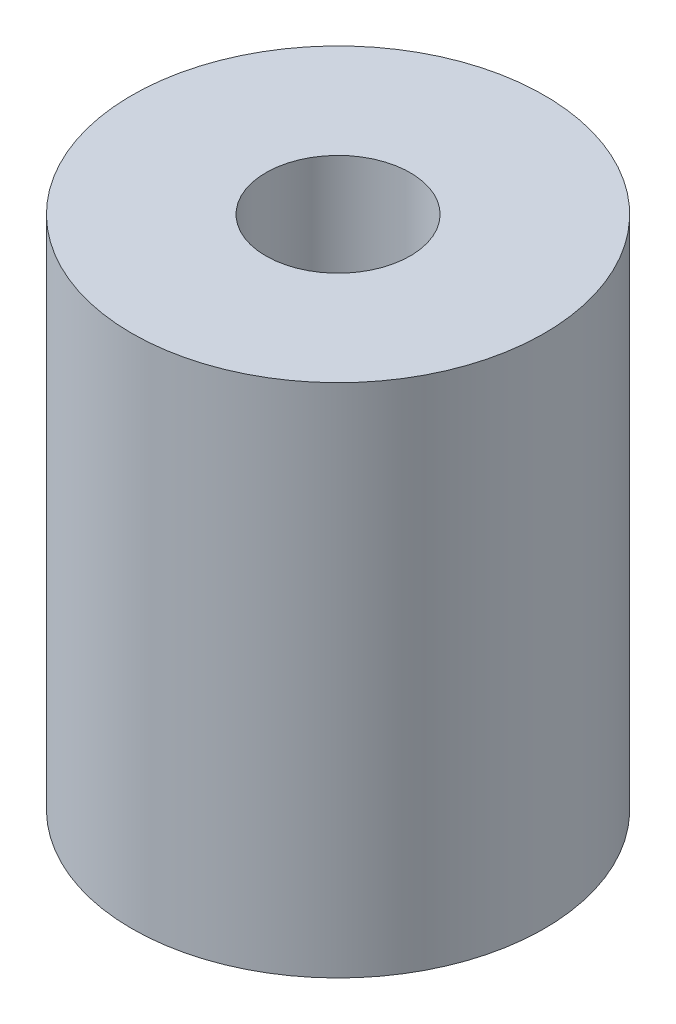
ISO-10303-21;
HEADER;
FILE_DESCRIPTION(('STEP AP214'),'2;1');
FILE_NAME('part.step','',(''),(''),'','','');
FILE_SCHEMA(('AUTOMOTIVE_DESIGN { 1 0 10303 214 1 1 1 1 }'));
ENDSEC;
DATA;
#1=APPLICATION_CONTEXT('core data for automotive mechanical design processes');
#2=APPLICATION_PROTOCOL_DEFINITION('international standard','automotive_design',2000,#1);
#3=PRODUCT_CONTEXT('',#1,'mechanical');
#4=PRODUCT('Part','Part','',(#3));
#5=PRODUCT_RELATED_PRODUCT_CATEGORY('part','',(#4));
#6=PRODUCT_DEFINITION_FORMATION('','',#4);
#7=PRODUCT_DEFINITION_CONTEXT('part definition',#1,'design');
#8=PRODUCT_DEFINITION('design','',#6,#7);
#9=PRODUCT_DEFINITION_SHAPE('','',#8);
#10=(LENGTH_UNIT() NAMED_UNIT(*) SI_UNIT(.MILLI.,.METRE.));
#11=(NAMED_UNIT(*) PLANE_ANGLE_UNIT() SI_UNIT($,.RADIAN.));
#12=(NAMED_UNIT(*) SI_UNIT($,.STERADIAN.) SOLID_ANGLE_UNIT());
#13=UNCERTAINTY_MEASURE_WITH_UNIT(LENGTH_MEASURE(1.E-05),#10,'distance_accuracy_value','');
#14=(GEOMETRIC_REPRESENTATION_CONTEXT(3) GLOBAL_UNCERTAINTY_ASSIGNED_CONTEXT((#13)) GLOBAL_UNIT_ASSIGNED_CONTEXT((#10,
#11,#12)) REPRESENTATION_CONTEXT('',''));
#15=CARTESIAN_POINT('',(0.,0.,0.));
#16=DIRECTION('',(0.,0.,1.));
#17=DIRECTION('',(1.,0.,0.));
#18=AXIS2_PLACEMENT_3D('',#15,#16,#17);
#19=CARTESIAN_POINT('',(0.,12.7,0.));
#20=DIRECTION('',(0.,1.,0.));
#21=DIRECTION('',(0.,0.,1.));
#22=AXIS2_PLACEMENT_3D('',#19,#20,#21);
#23=PLANE('',#22);
#24=CARTESIAN_POINT('',(0.,12.7,0.));
#25=DIRECTION('',(0.,1.,0.));
#26=DIRECTION('',(0.,0.,1.));
#27=AXIS2_PLACEMENT_3D('',#24,#25,#26);
#28=CIRCLE('',#27,5.08);
#29=CARTESIAN_POINT('',(0.,12.7,5.08));
#30=VERTEX_POINT('',#29);
#31=EDGE_CURVE('E11',#30,#30,#28,.T.);
#32=ORIENTED_EDGE('',*,*,#31,.T.);
#33=EDGE_LOOP('',(#32));
#34=FACE_BOUND('',#33,.T.);
#35=CARTESIAN_POINT('',(0.,12.7,0.));
#36=DIRECTION('',(0.,1.,0.));
#37=DIRECTION('',(0.,0.,1.));
#38=AXIS2_PLACEMENT_3D('',#35,#36,#37);
#39=CIRCLE('',#38,1.778);
#40=CARTESIAN_POINT('',(0.,12.7,1.778));
#41=VERTEX_POINT('',#40);
#42=EDGE_CURVE('E60',#41,#41,#39,.T.);
#43=ORIENTED_EDGE('',*,*,#42,.F.);
#44=EDGE_LOOP('',(#43));
#45=FACE_BOUND('',#44,.T.);
#46=ADVANCED_FACE('F47',(#34,#45),#23,.T.);
#47=CARTESIAN_POINT('',(0.,0.,0.));
#48=DIRECTION('',(0.,1.,0.));
#49=DIRECTION('',(0.,0.,1.));
#50=AXIS2_PLACEMENT_3D('',#47,#48,#49);
#51=PLANE('',#50);
#52=CARTESIAN_POINT('',(0.,0.,0.));
#53=DIRECTION('',(0.,1.,0.));
#54=DIRECTION('',(0.,0.,1.));
#55=AXIS2_PLACEMENT_3D('',#52,#53,#54);
#56=CIRCLE('',#55,5.08);
#57=CARTESIAN_POINT('',(0.,0.,5.08));
#58=VERTEX_POINT('',#57);
#59=EDGE_CURVE('E51',#58,#58,#56,.T.);
#60=ORIENTED_EDGE('',*,*,#59,.F.);
#61=EDGE_LOOP('',(#60));
#62=FACE_BOUND('',#61,.T.);
#63=CARTESIAN_POINT('',(0.,0.,0.));
#64=DIRECTION('',(0.,1.,0.));
#65=DIRECTION('',(0.,0.,1.));
#66=AXIS2_PLACEMENT_3D('',#63,#64,#65);
#67=CIRCLE('',#66,1.778);
#68=CARTESIAN_POINT('',(0.,0.,1.778));
#69=VERTEX_POINT('',#68);
#70=EDGE_CURVE('E62',#69,#69,#67,.T.);
#71=ORIENTED_EDGE('',*,*,#70,.T.);
#72=EDGE_LOOP('',(#71));
#73=FACE_BOUND('',#72,.T.);
#74=ADVANCED_FACE('F74',(#62,#73),#51,.F.);
#75=CARTESIAN_POINT('',(0.,12.7,0.));
#76=DIRECTION('',(0.,-1.,0.));
#77=DIRECTION('',(0.,0.,-1.));
#78=AXIS2_PLACEMENT_3D('',#75,#76,#77);
#79=CYLINDRICAL_SURFACE('',#78,5.08);
#80=ORIENTED_EDGE('',*,*,#31,.F.);
#81=EDGE_LOOP('',(#80));
#82=FACE_BOUND('',#81,.T.);
#83=ORIENTED_EDGE('',*,*,#59,.T.);
#84=EDGE_LOOP('',(#83));
#85=FACE_BOUND('',#84,.T.);
#86=ADVANCED_FACE('F49',(#82,#85),#79,.T.);
#87=CARTESIAN_POINT('',(0.,12.7,0.));
#88=DIRECTION('',(0.,-1.,0.));
#89=DIRECTION('',(0.,0.,-1.));
#90=AXIS2_PLACEMENT_3D('',#87,#88,#89);
#91=CYLINDRICAL_SURFACE('',#90,1.778);
#92=ORIENTED_EDGE('',*,*,#42,.T.);
#93=EDGE_LOOP('',(#92));
#94=FACE_BOUND('',#93,.T.);
#95=ORIENTED_EDGE('',*,*,#70,.F.);
#96=EDGE_LOOP('',(#95));
#97=FACE_BOUND('',#96,.T.);
#98=ADVANCED_FACE('F70',(#94,#97),#91,.F.);
#99=CLOSED_SHELL('',(#46,#74,#86,#98));
#100=MANIFOLD_SOLID_BREP('B2',#99);
#101=ADVANCED_BREP_SHAPE_REPRESENTATION('',(#18,#100),#14);
#102=SHAPE_DEFINITION_REPRESENTATION(#9,#101);
ENDSEC;
END-ISO-10303-21;
